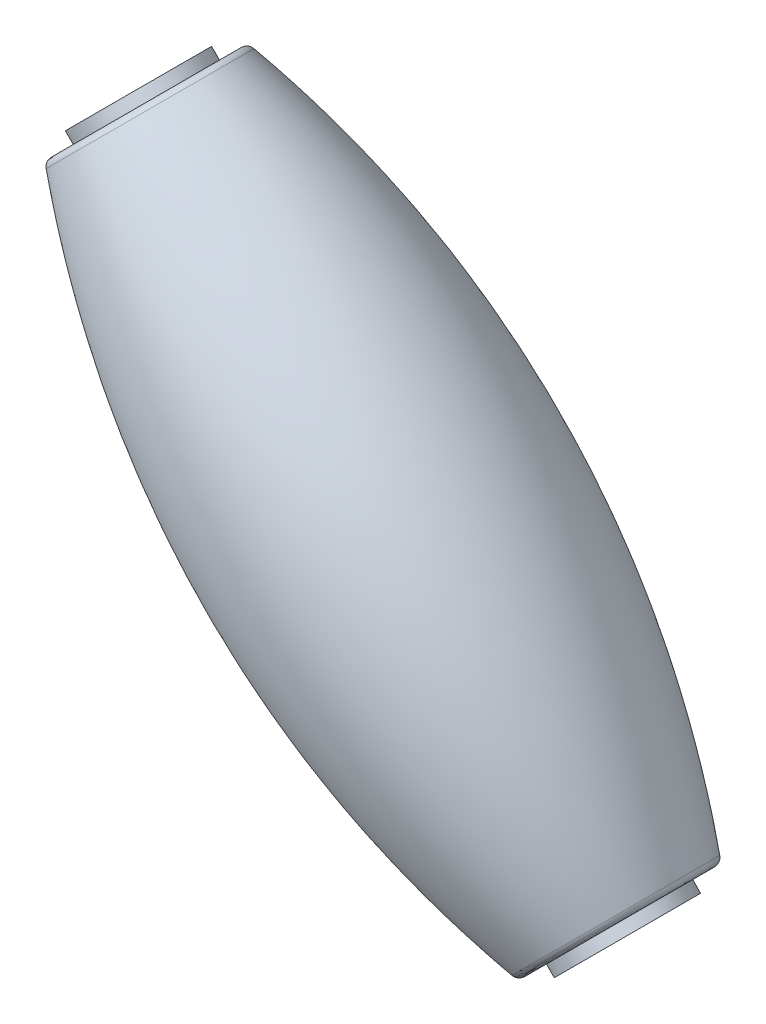
ISO-10303-21;
HEADER;
FILE_DESCRIPTION(('STEP AP214'),'2;1');
FILE_NAME('part.step','',(''),(''),'','','');
FILE_SCHEMA(('AUTOMOTIVE_DESIGN { 1 0 10303 214 1 1 1 1 }'));
ENDSEC;
DATA;
#1=APPLICATION_CONTEXT('core data for automotive mechanical design processes');
#2=APPLICATION_PROTOCOL_DEFINITION('international standard','automotive_design',2000,#1);
#3=PRODUCT_CONTEXT('',#1,'mechanical');
#4=PRODUCT('Part','Part','',(#3));
#5=PRODUCT_RELATED_PRODUCT_CATEGORY('part','',(#4));
#6=PRODUCT_DEFINITION_FORMATION('','',#4);
#7=PRODUCT_DEFINITION_CONTEXT('part definition',#1,'design');
#8=PRODUCT_DEFINITION('design','',#6,#7);
#9=PRODUCT_DEFINITION_SHAPE('','',#8);
#10=(LENGTH_UNIT() NAMED_UNIT(*) SI_UNIT(.MILLI.,.METRE.));
#11=(NAMED_UNIT(*) PLANE_ANGLE_UNIT() SI_UNIT($,.RADIAN.));
#12=(NAMED_UNIT(*) SI_UNIT($,.STERADIAN.) SOLID_ANGLE_UNIT());
#13=UNCERTAINTY_MEASURE_WITH_UNIT(LENGTH_MEASURE(1.E-05),#10,'distance_accuracy_value','');
#14=(GEOMETRIC_REPRESENTATION_CONTEXT(3) GLOBAL_UNCERTAINTY_ASSIGNED_CONTEXT((#13)) GLOBAL_UNIT_ASSIGNED_CONTEXT((#10,
#11,#12)) REPRESENTATION_CONTEXT('',''));
#15=CARTESIAN_POINT('',(0.,0.,0.));
#16=DIRECTION('',(0.,0.,1.));
#17=DIRECTION('',(1.,0.,0.));
#18=AXIS2_PLACEMENT_3D('',#15,#16,#17);
#19=CARTESIAN_POINT('',(22.2665612295965,69.3320512053089,0.));
#20=DIRECTION('',(0.707106781186548,-0.707106781186548,0.));
#21=DIRECTION('',(0.707106781186548,0.707106781186548,0.));
#22=AXIS2_PLACEMENT_3D('',#19,#20,#21);
#23=CYLINDRICAL_SURFACE('',#22,1.5875);
#24=CARTESIAN_POINT('',(26.3121504347326,65.2864620001727,0.));
#25=DIRECTION('',(0.707106781186548,-0.707106781186548,0.));
#26=DIRECTION('',(0.707106781186548,0.707106781186548,0.));
#27=AXIS2_PLACEMENT_3D('',#24,#25,#26);
#28=CIRCLE('',#27,1.5875);
#29=CARTESIAN_POINT('',(27.4346824498663,66.4089940153064,0.));
#30=VERTEX_POINT('',#29);
#31=EDGE_CURVE('E237',#30,#30,#28,.F.);
#32=ORIENTED_EDGE('',*,*,#31,.T.);
#33=EDGE_LOOP('',(#32));
#34=FACE_BOUND('',#33,.T.);
#35=CARTESIAN_POINT('',(65.2864620001728,26.3121504347326,0.));
#36=DIRECTION('',(0.707106781186548,-0.707106781186548,0.));
#37=DIRECTION('',(0.707106781186548,0.707106781186548,0.));
#38=AXIS2_PLACEMENT_3D('',#35,#36,#37);
#39=CIRCLE('',#38,1.5875);
#40=CARTESIAN_POINT('',(66.4089940153064,27.4346824498662,0.));
#41=VERTEX_POINT('',#40);
#42=EDGE_CURVE('E240',#41,#41,#39,.F.);
#43=ORIENTED_EDGE('',*,*,#42,.F.);
#44=EDGE_LOOP('',(#43));
#45=FACE_BOUND('',#44,.T.);
#46=ADVANCED_FACE('F17',(#34,#45),#23,.F.);
#47=CARTESIAN_POINT('',(19.4871557827201,-19.4871557827201,0.));
#48=DIRECTION('',(0.707106781186548,-0.707106781186547,0.));
#49=DIRECTION('',(0.707106781186547,0.707106781186548,0.));
#50=AXIS2_PLACEMENT_3D('',#47,#48,#49);
#51=PLANE('',#50);
#52=CARTESIAN_POINT('',(65.2864620001727,26.3121504347326,0.));
#53=DIRECTION('',(0.707106781186548,-0.707106781186548,0.));
#54=DIRECTION('',(0.707106781186548,0.707106781186548,0.));
#55=AXIS2_PLACEMENT_3D('',#52,#53,#54);
#56=CIRCLE('',#55,4.7625);
#57=CARTESIAN_POINT('',(68.6540580455737,29.6797464801335,0.));
#58=VERTEX_POINT('',#57);
#59=EDGE_CURVE('E232',#58,#58,#56,.F.);
#60=ORIENTED_EDGE('',*,*,#59,.F.);
#61=EDGE_LOOP('',(#60));
#62=FACE_BOUND('',#61,.T.);
#63=ORIENTED_EDGE('',*,*,#42,.T.);
#64=EDGE_LOOP('',(#63));
#65=FACE_BOUND('',#64,.T.);
#66=ADVANCED_FACE('F136',(#62,#65),#51,.T.);
#67=CARTESIAN_POINT('',(26.3121504347326,65.2864620001727,0.));
#68=DIRECTION('',(0.707106781186548,-0.707106781186548,0.));
#69=DIRECTION('',(0.707106781186548,0.707106781186548,0.));
#70=AXIS2_PLACEMENT_3D('',#67,#68,#69);
#71=PLANE('',#70);
#72=CARTESIAN_POINT('',(26.3121504347326,65.2864620001727,0.));
#73=DIRECTION('',(0.707106781186548,-0.707106781186548,0.));
#74=DIRECTION('',(0.707106781186548,0.707106781186548,0.));
#75=AXIS2_PLACEMENT_3D('',#72,#73,#74);
#76=CIRCLE('',#75,4.7625);
#77=CARTESIAN_POINT('',(29.6797464801335,68.6540580455737,0.));
#78=VERTEX_POINT('',#77);
#79=EDGE_CURVE('E229',#78,#78,#76,.T.);
#80=ORIENTED_EDGE('',*,*,#79,.F.);
#81=EDGE_LOOP('',(#80));
#82=FACE_BOUND('',#81,.T.);
#83=ORIENTED_EDGE('',*,*,#31,.F.);
#84=EDGE_LOOP('',(#83));
#85=FACE_BOUND('',#84,.T.);
#86=ADVANCED_FACE('F133',(#82,#85),#71,.F.);
#87=CARTESIAN_POINT('',(16.1585325062578,75.4400799286476,0.));
#88=DIRECTION('',(0.707106781186548,-0.707106781186548,0.));
#89=DIRECTION('',(0.707106781186548,0.707106781186548,0.));
#90=AXIS2_PLACEMENT_3D('',#87,#88,#89);
#91=CYLINDRICAL_SURFACE('',#90,4.7625);
#92=CARTESIAN_POINT('',(64.6578440716979,26.9407683632074,0.));
#93=DIRECTION('',(0.707106781186548,-0.707106781186548,0.));
#94=DIRECTION('',(0.707106781186548,0.707106781186548,0.));
#95=AXIS2_PLACEMENT_3D('',#92,#93,#94);
#96=CIRCLE('',#95,4.7625);
#97=CARTESIAN_POINT('',(68.0254401170988,30.3083644086084,0.));
#98=VERTEX_POINT('',#97);
#99=EDGE_CURVE('E227',#98,#98,#96,.T.);
#100=ORIENTED_EDGE('',*,*,#99,.T.);
#101=EDGE_LOOP('',(#100));
#102=FACE_BOUND('',#101,.T.);
#103=ORIENTED_EDGE('',*,*,#59,.T.);
#104=EDGE_LOOP('',(#103));
#105=FACE_BOUND('',#104,.T.);
#106=ADVANCED_FACE('F129',(#102,#105),#91,.T.);
#107=CARTESIAN_POINT('',(16.1585325062578,75.4400799286476,0.));
#108=DIRECTION('',(0.707106781186548,-0.707106781186548,0.));
#109=DIRECTION('',(0.707106781186548,0.707106781186548,0.));
#110=AXIS2_PLACEMENT_3D('',#107,#108,#109);
#111=CYLINDRICAL_SURFACE('',#110,4.7625);
#112=CARTESIAN_POINT('',(26.9407683632074,64.6578440716979,0.));
#113=DIRECTION('',(0.707106781186548,-0.707106781186548,0.));
#114=DIRECTION('',(0.707106781186548,0.707106781186548,0.));
#115=AXIS2_PLACEMENT_3D('',#112,#113,#114);
#116=CIRCLE('',#115,4.7625);
#117=CARTESIAN_POINT('',(30.3083644086084,68.0254401170988,0.));
#118=VERTEX_POINT('',#117);
#119=EDGE_CURVE('E53',#118,#118,#116,.F.);
#120=ORIENTED_EDGE('',*,*,#119,.T.);
#121=EDGE_LOOP('',(#120));
#122=FACE_BOUND('',#121,.T.);
#123=ORIENTED_EDGE('',*,*,#79,.T.);
#124=EDGE_LOOP('',(#123));
#125=FACE_BOUND('',#124,.T.);
#126=ADVANCED_FACE('F125',(#122,#125),#111,.T.);
#127=CARTESIAN_POINT('',(64.6578440716979,26.9407683632075,0.));
#128=DIRECTION('',(-0.707106781186548,0.707106781186548,0.));
#129=DIRECTION('',(-0.707106781186548,-0.707106781186548,0.));
#130=AXIS2_PLACEMENT_3D('',#127,#128,#129);
#131=PLANE('',#130);
#132=CARTESIAN_POINT('',(64.6578440716979,26.9407683632075,0.));
#133=DIRECTION('',(-0.707106781186548,0.707106781186548,0.));
#134=DIRECTION('',(-0.707106781186547,-0.707106781186547,0.));
#135=AXIS2_PLACEMENT_3D('',#132,#133,#134);
#136=CIRCLE('',#135,6.16833942234622);
#137=CARTESIAN_POINT('',(60.2961694374966,22.5790937290061,0.));
#138=VERTEX_POINT('',#137);
#139=CARTESIAN_POINT('',(69.0195187058992,31.3024429974088,0.));
#140=VERTEX_POINT('',#139);
#141=EDGE_CURVE('E45',#138,#140,#136,.T.);
#142=ORIENTED_EDGE('',*,*,#141,.F.);
#143=CARTESIAN_POINT('',(64.6578440716979,26.9407683632075,0.));
#144=DIRECTION('',(-0.707106781186548,0.707106781186548,0.));
#145=DIRECTION('',(0.707106781186547,0.707106781186547,0.));
#146=AXIS2_PLACEMENT_3D('',#143,#144,#145);
#147=CIRCLE('',#146,6.16833942234622);
#148=EDGE_CURVE('E48',#140,#138,#147,.T.);
#149=ORIENTED_EDGE('',*,*,#148,.F.);
#150=EDGE_LOOP('',(#142,#149));
#151=FACE_BOUND('',#150,.T.);
#152=ORIENTED_EDGE('',*,*,#99,.F.);
#153=EDGE_LOOP('',(#152));
#154=FACE_BOUND('',#153,.T.);
#155=ADVANCED_FACE('F50',(#151,#154),#131,.F.);
#156=CARTESIAN_POINT('',(26.9407683632075,64.6578440716979,0.));
#157=DIRECTION('',(0.707106781186548,-0.707106781186548,0.));
#158=DIRECTION('',(0.707106781186548,0.707106781186548,0.));
#159=AXIS2_PLACEMENT_3D('',#156,#157,#158);
#160=PLANE('',#159);
#161=CARTESIAN_POINT('',(26.9407683632075,64.6578440716979,0.));
#162=DIRECTION('',(0.707106781186548,-0.707106781186548,0.));
#163=DIRECTION('',(0.707106781186547,0.707106781186547,0.));
#164=AXIS2_PLACEMENT_3D('',#161,#162,#163);
#165=CIRCLE('',#164,6.16833942234622);
#166=CARTESIAN_POINT('',(31.3024429974088,69.0195187058992,0.));
#167=VERTEX_POINT('',#166);
#168=CARTESIAN_POINT('',(22.5790937290061,60.2961694374966,0.));
#169=VERTEX_POINT('',#168);
#170=EDGE_CURVE('E58',#167,#169,#165,.T.);
#171=ORIENTED_EDGE('',*,*,#170,.F.);
#172=CARTESIAN_POINT('',(26.9407683632075,64.6578440716979,0.));
#173=DIRECTION('',(0.707106781186548,-0.707106781186548,0.));
#174=DIRECTION('',(-0.707106781186547,-0.707106781186547,0.));
#175=AXIS2_PLACEMENT_3D('',#172,#173,#174);
#176=CIRCLE('',#175,6.16833942234622);
#177=EDGE_CURVE('E36',#169,#167,#176,.T.);
#178=ORIENTED_EDGE('',*,*,#177,.F.);
#179=EDGE_LOOP('',(#171,#178));
#180=FACE_BOUND('',#179,.T.);
#181=ORIENTED_EDGE('',*,*,#119,.F.);
#182=EDGE_LOOP('',(#181));
#183=FACE_BOUND('',#182,.T.);
#184=ADVANCED_FACE('F78',(#180,#183),#160,.F.);
#185=CARTESIAN_POINT('',(64.2088312656444,27.3897811692609,0.));
#186=DIRECTION('',(-0.707106781186548,0.707106781186548,0.));
#187=DIRECTION('',(-0.707106781186547,-0.707106781186547,0.));
#188=AXIS2_PLACEMENT_3D('',#185,#186,#187);
#189=TOROIDAL_SURFACE('',#188,6.16833942234622,0.635);
#190=CARTESIAN_POINT('',(64.3635331568057,27.2350792780996,0.));
#191=DIRECTION('',(-0.707106781186548,0.707106781186548,0.));
#192=DIRECTION('',(-0.707106781186548,-0.707106781186547,0.));
#193=AXIS2_PLACEMENT_3D('',#190,#191,#192);
#194=CIRCLE('',#193,6.76445992169367);
#195=CARTESIAN_POINT('',(59.5803376751115,22.4518837964054,0.));
#196=VERTEX_POINT('',#195);
#197=EDGE_CURVE('E28',#196,#196,#194,.T.);
#198=ORIENTED_EDGE('',*,*,#197,.F.);
#199=EDGE_LOOP('',(#198));
#200=FACE_BOUND('',#199,.T.);
#201=ORIENTED_EDGE('',*,*,#141,.T.);
#202=ORIENTED_EDGE('',*,*,#148,.T.);
#203=EDGE_LOOP('',(#201,#202));
#204=FACE_BOUND('',#203,.T.);
#205=ADVANCED_FACE('F57',(#200,#204),#189,.T.);
#206=CARTESIAN_POINT('',(27.3897811692609,64.2088312656444,0.));
#207=DIRECTION('',(0.707106781186548,-0.707106781186548,0.));
#208=DIRECTION('',(0.707106781186547,0.707106781186547,0.));
#209=AXIS2_PLACEMENT_3D('',#206,#207,#208);
#210=TOROIDAL_SURFACE('',#209,6.16833942234622,0.635);
#211=CARTESIAN_POINT('',(27.2350792780997,64.3635331568057,0.));
#212=DIRECTION('',(-0.707106781186548,0.707106781186548,0.));
#213=DIRECTION('',(-0.707106781186547,-0.707106781186548,0.));
#214=AXIS2_PLACEMENT_3D('',#211,#212,#213);
#215=CIRCLE('',#214,6.76445992169366);
#216=CARTESIAN_POINT('',(22.4518837964054,59.5803376751115,0.));
#217=VERTEX_POINT('',#216);
#218=EDGE_CURVE('E11',#217,#217,#215,.F.);
#219=ORIENTED_EDGE('',*,*,#218,.F.);
#220=EDGE_LOOP('',(#219));
#221=FACE_BOUND('',#220,.T.);
#222=ORIENTED_EDGE('',*,*,#170,.T.);
#223=ORIENTED_EDGE('',*,*,#177,.T.);
#224=EDGE_LOOP('',(#222,#223));
#225=FACE_BOUND('',#224,.T.);
#226=ADVANCED_FACE('F77',(#221,#225),#210,.T.);
#227=CARTESIAN_POINT('',(91.5986124349054,91.5986124349054,0.));
#228=DIRECTION('',(0.,0.,1.));
#229=DIRECTION('',(-0.707106781186548,-0.707106781186548,0.));
#230=AXIS2_PLACEMENT_3D('',#227,#228,#229);
#231=CIRCLE('',#230,76.2);
#232=TRIMMED_CURVE('',#231,(PARAMETER_VALUE(-0.554811032980071)),
(PARAMETER_VALUE(0.554811032980071)),.T.,.PARAMETER.);
#233=CARTESIAN_POINT('',(45.7993062174527,45.7993062174527,0.));
#234=DIRECTION('',(-0.707106781186548,0.707106781186548,0.));
#235=AXIS1_PLACEMENT('',#233,#234);
#236=SURFACE_OF_REVOLUTION('',#232,#235);
#237=ORIENTED_EDGE('',*,*,#218,.T.);
#238=EDGE_LOOP('',(#237));
#239=FACE_BOUND('',#238,.T.);
#240=ORIENTED_EDGE('',*,*,#197,.T.);
#241=EDGE_LOOP('',(#240));
#242=FACE_BOUND('',#241,.T.);
#243=ADVANCED_FACE('F147',(#239,#242),#236,.F.);
#244=CLOSED_SHELL('',(#46,#66,#86,#106,#126,#155,#184,#205,#226,#243));
#245=MANIFOLD_SOLID_BREP('B1',#244);
#246=ADVANCED_BREP_SHAPE_REPRESENTATION('',(#18,#245),#14);
#247=SHAPE_DEFINITION_REPRESENTATION(#9,#246);
ENDSEC;
END-ISO-10303-21;
